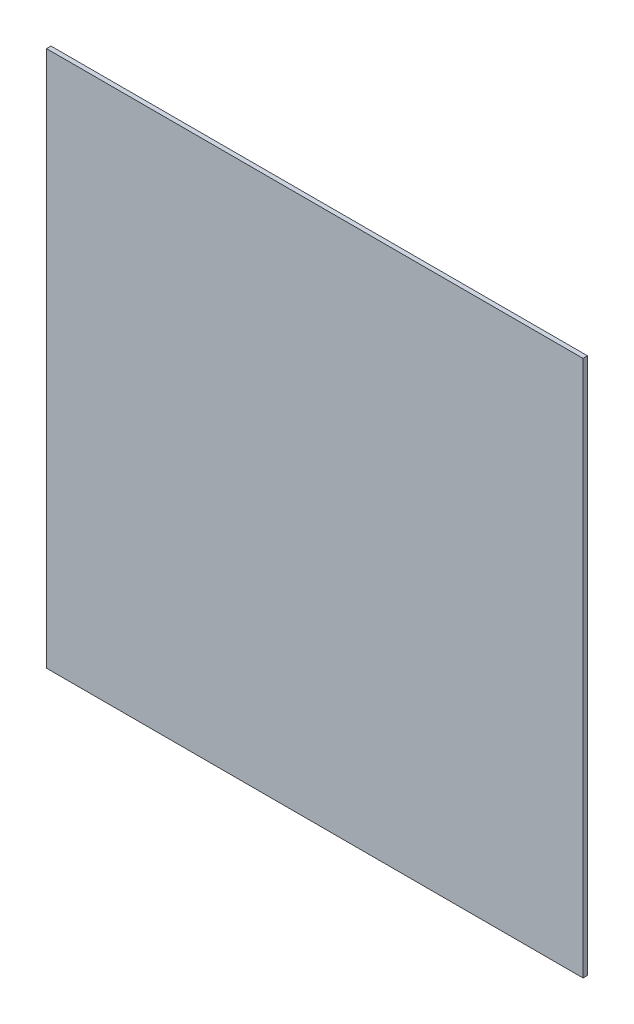
ISO-10303-21;
HEADER;
FILE_DESCRIPTION(('STEP AP214'),'2;1');
FILE_NAME('part.step','',(''),(''),'','','');
FILE_SCHEMA(('AUTOMOTIVE_DESIGN { 1 0 10303 214 1 1 1 1 }'));
ENDSEC;
DATA;
#1=APPLICATION_CONTEXT('core data for automotive mechanical design processes');
#2=APPLICATION_PROTOCOL_DEFINITION('international standard','automotive_design',2000,#1);
#3=PRODUCT_CONTEXT('',#1,'mechanical');
#4=PRODUCT('Part','Part','',(#3));
#5=PRODUCT_RELATED_PRODUCT_CATEGORY('part','',(#4));
#6=PRODUCT_DEFINITION_FORMATION('','',#4);
#7=PRODUCT_DEFINITION_CONTEXT('part definition',#1,'design');
#8=PRODUCT_DEFINITION('design','',#6,#7);
#9=PRODUCT_DEFINITION_SHAPE('','',#8);
#10=(LENGTH_UNIT() NAMED_UNIT(*) SI_UNIT(.MILLI.,.METRE.));
#11=(NAMED_UNIT(*) PLANE_ANGLE_UNIT() SI_UNIT($,.RADIAN.));
#12=(NAMED_UNIT(*) SI_UNIT($,.STERADIAN.) SOLID_ANGLE_UNIT());
#13=UNCERTAINTY_MEASURE_WITH_UNIT(LENGTH_MEASURE(1.E-05),#10,'distance_accuracy_value','');
#14=(GEOMETRIC_REPRESENTATION_CONTEXT(3) GLOBAL_UNCERTAINTY_ASSIGNED_CONTEXT((#13)) GLOBAL_UNIT_ASSIGNED_CONTEXT((#10,
#11,#12)) REPRESENTATION_CONTEXT('',''));
#15=CARTESIAN_POINT('',(0.,0.,0.));
#16=DIRECTION('',(0.,0.,1.));
#17=DIRECTION('',(1.,0.,0.));
#18=AXIS2_PLACEMENT_3D('',#15,#16,#17);
#19=CARTESIAN_POINT('',(0.,0.,3.));
#20=DIRECTION('',(0.,0.,1.));
#21=DIRECTION('',(1.,0.,0.));
#22=AXIS2_PLACEMENT_3D('',#19,#20,#21);
#23=PLANE('',#22);
#24=DIRECTION('',(0.,1.,0.));
#25=VECTOR('',#24,1.);
#26=CARTESIAN_POINT('',(600.000000000009,-600.000000000009,3.));
#27=LINE('',#26,#25);
#28=CARTESIAN_POINT('',(600.000000000009,600.000000000009,3.));
#29=VERTEX_POINT('',#28);
#30=CARTESIAN_POINT('',(600.000000000009,-600.000000000009,3.));
#31=VERTEX_POINT('',#30);
#32=EDGE_CURVE('E75',#29,#31,#27,.F.);
#33=ORIENTED_EDGE('',*,*,#32,.F.);
#34=DIRECTION('',(-1.,0.,0.));
#35=VECTOR('',#34,1.);
#36=CARTESIAN_POINT('',(600.000000000009,600.000000000009,3.));
#37=LINE('',#36,#35);
#38=CARTESIAN_POINT('',(-600.000000000009,600.000000000009,3.));
#39=VERTEX_POINT('',#38);
#40=EDGE_CURVE('E94',#39,#29,#37,.F.);
#41=ORIENTED_EDGE('',*,*,#40,.F.);
#42=DIRECTION('',(0.,1.,0.));
#43=VECTOR('',#42,1.);
#44=CARTESIAN_POINT('',(-600.000000000009,-600.000000000009,3.));
#45=LINE('',#44,#43);
#46=CARTESIAN_POINT('',(-600.000000000009,-600.000000000009,3.));
#47=VERTEX_POINT('',#46);
#48=EDGE_CURVE('E87',#47,#39,#45,.T.);
#49=ORIENTED_EDGE('',*,*,#48,.F.);
#50=DIRECTION('',(1.,0.,0.));
#51=VECTOR('',#50,1.);
#52=CARTESIAN_POINT('',(600.000000000009,-600.000000000009,3.));
#53=LINE('',#52,#51);
#54=EDGE_CURVE('E41',#31,#47,#53,.F.);
#55=ORIENTED_EDGE('',*,*,#54,.F.);
#56=EDGE_LOOP('',(#33,#41,#49,#55));
#57=FACE_BOUND('',#56,.T.);
#58=ADVANCED_FACE('F38',(#57),#23,.T.);
#59=CARTESIAN_POINT('',(600.000000000009,-600.000000000009,-7.00000000000001));
#60=DIRECTION('',(0.,-1.,0.));
#61=DIRECTION('',(1.,0.,0.));
#62=AXIS2_PLACEMENT_3D('',#59,#60,#61);
#63=PLANE('',#62);
#64=DIRECTION('',(1.,0.,0.));
#65=VECTOR('',#64,1.);
#66=CARTESIAN_POINT('',(600.000000000009,-600.000000000009,-7.00000000000001));
#67=LINE('',#66,#65);
#68=CARTESIAN_POINT('',(-600.000000000009,-600.000000000009,-7.00000000000001));
#69=VERTEX_POINT('',#68);
#70=CARTESIAN_POINT('',(600.000000000009,-600.000000000009,-7.00000000000001));
#71=VERTEX_POINT('',#70);
#72=EDGE_CURVE('E93',#69,#71,#67,.T.);
#73=ORIENTED_EDGE('',*,*,#72,.T.);
#74=DIRECTION('',(0.,0.,-1.));
#75=VECTOR('',#74,1.);
#76=CARTESIAN_POINT('',(600.000000000009,-600.000000000009,-7.00000000000001));
#77=LINE('',#76,#75);
#78=EDGE_CURVE('E80',#31,#71,#77,.T.);
#79=ORIENTED_EDGE('',*,*,#78,.F.);
#80=ORIENTED_EDGE('',*,*,#54,.T.);
#81=DIRECTION('',(0.,0.,1.));
#82=VECTOR('',#81,1.);
#83=CARTESIAN_POINT('',(-600.000000000009,-600.000000000009,-7.00000000000001));
#84=LINE('',#83,#82);
#85=EDGE_CURVE('E105',#69,#47,#84,.T.);
#86=ORIENTED_EDGE('',*,*,#85,.F.);
#87=EDGE_LOOP('',(#73,#79,#80,#86));
#88=FACE_BOUND('',#87,.T.);
#89=ADVANCED_FACE('F92',(#88),#63,.T.);
#90=CARTESIAN_POINT('',(600.000000000009,-600.000000000009,-7.00000000000001));
#91=DIRECTION('',(1.,0.,0.));
#92=DIRECTION('',(0.,0.,-1.));
#93=AXIS2_PLACEMENT_3D('',#90,#91,#92);
#94=PLANE('',#93);
#95=DIRECTION('',(0.,1.,0.));
#96=VECTOR('',#95,1.);
#97=CARTESIAN_POINT('',(600.000000000009,-600.000000000009,-7.00000000000001));
#98=LINE('',#97,#96);
#99=CARTESIAN_POINT('',(600.000000000009,600.000000000009,-7.00000000000001));
#100=VERTEX_POINT('',#99);
#101=EDGE_CURVE('E102',#71,#100,#98,.T.);
#102=ORIENTED_EDGE('',*,*,#101,.T.);
#103=DIRECTION('',(0.,0.,1.));
#104=VECTOR('',#103,1.);
#105=CARTESIAN_POINT('',(600.000000000009,600.000000000009,-7.00000000000001));
#106=LINE('',#105,#104);
#107=EDGE_CURVE('E82',#29,#100,#106,.F.);
#108=ORIENTED_EDGE('',*,*,#107,.F.);
#109=ORIENTED_EDGE('',*,*,#32,.T.);
#110=ORIENTED_EDGE('',*,*,#78,.T.);
#111=EDGE_LOOP('',(#102,#108,#109,#110));
#112=FACE_BOUND('',#111,.T.);
#113=ADVANCED_FACE('F78',(#112),#94,.T.);
#114=CARTESIAN_POINT('',(600.000000000009,600.000000000009,-7.00000000000001));
#115=DIRECTION('',(0.,1.,0.));
#116=DIRECTION('',(-1.,0.,0.));
#117=AXIS2_PLACEMENT_3D('',#114,#115,#116);
#118=PLANE('',#117);
#119=DIRECTION('',(-1.,0.,0.));
#120=VECTOR('',#119,1.);
#121=CARTESIAN_POINT('',(600.000000000009,600.000000000009,-7.00000000000001));
#122=LINE('',#121,#120);
#123=CARTESIAN_POINT('',(-600.000000000009,600.000000000009,-7.00000000000001));
#124=VERTEX_POINT('',#123);
#125=EDGE_CURVE('E47',#100,#124,#122,.T.);
#126=ORIENTED_EDGE('',*,*,#125,.T.);
#127=DIRECTION('',(0.,0.,1.));
#128=VECTOR('',#127,1.);
#129=CARTESIAN_POINT('',(-600.000000000009,600.000000000009,-7.00000000000001));
#130=LINE('',#129,#128);
#131=EDGE_CURVE('E55',#39,#124,#130,.F.);
#132=ORIENTED_EDGE('',*,*,#131,.F.);
#133=ORIENTED_EDGE('',*,*,#40,.T.);
#134=ORIENTED_EDGE('',*,*,#107,.T.);
#135=EDGE_LOOP('',(#126,#132,#133,#134));
#136=FACE_BOUND('',#135,.T.);
#137=ADVANCED_FACE('F109',(#136),#118,.T.);
#138=CARTESIAN_POINT('',(-600.000000000009,-600.000000000009,-7.00000000000001));
#139=DIRECTION('',(-1.,0.,0.));
#140=DIRECTION('',(0.,0.,1.));
#141=AXIS2_PLACEMENT_3D('',#138,#139,#140);
#142=PLANE('',#141);
#143=DIRECTION('',(0.,1.,0.));
#144=VECTOR('',#143,1.);
#145=CARTESIAN_POINT('',(-600.000000000009,-600.000000000009,-7.00000000000001));
#146=LINE('',#145,#144);
#147=EDGE_CURVE('E11',#124,#69,#146,.F.);
#148=ORIENTED_EDGE('',*,*,#147,.T.);
#149=ORIENTED_EDGE('',*,*,#85,.T.);
#150=ORIENTED_EDGE('',*,*,#48,.T.);
#151=ORIENTED_EDGE('',*,*,#131,.T.);
#152=EDGE_LOOP('',(#148,#149,#150,#151));
#153=FACE_BOUND('',#152,.T.);
#154=ADVANCED_FACE('F112',(#153),#142,.T.);
#155=CARTESIAN_POINT('',(0.,0.,-7.00000000000001));
#156=DIRECTION('',(0.,0.,1.));
#157=DIRECTION('',(1.,0.,0.));
#158=AXIS2_PLACEMENT_3D('',#155,#156,#157);
#159=PLANE('',#158);
#160=ORIENTED_EDGE('',*,*,#125,.F.);
#161=ORIENTED_EDGE('',*,*,#101,.F.);
#162=ORIENTED_EDGE('',*,*,#72,.F.);
#163=ORIENTED_EDGE('',*,*,#147,.F.);
#164=EDGE_LOOP('',(#160,#161,#162,#163));
#165=FACE_BOUND('',#164,.T.);
#166=ADVANCED_FACE('F111',(#165),#159,.F.);
#167=CLOSED_SHELL('',(#58,#89,#113,#137,#154,#166));
#168=MANIFOLD_SOLID_BREP('B2',#167);
#169=ADVANCED_BREP_SHAPE_REPRESENTATION('',(#18,#168),#14);
#170=SHAPE_DEFINITION_REPRESENTATION(#9,#169);
ENDSEC;
END-ISO-10303-21;
